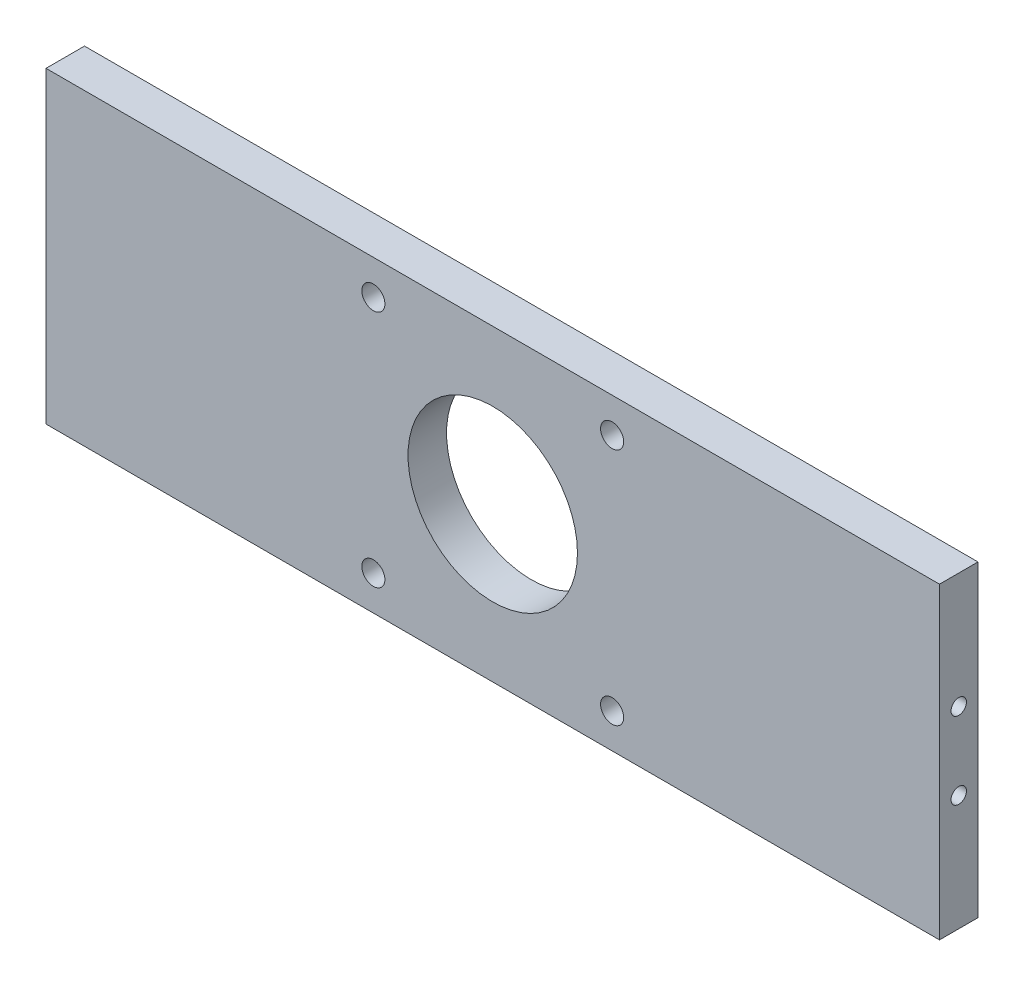
ISO-10303-21;
HEADER;
FILE_DESCRIPTION(('STEP AP214'),'2;1');
FILE_NAME('part.step','',(''),(''),'','','');
FILE_SCHEMA(('AUTOMOTIVE_DESIGN { 1 0 10303 214 1 1 1 1 }'));
ENDSEC;
DATA;
#1=APPLICATION_CONTEXT('core data for automotive mechanical design processes');
#2=APPLICATION_PROTOCOL_DEFINITION('international standard','automotive_design',2000,#1);
#3=PRODUCT_CONTEXT('',#1,'mechanical');
#4=PRODUCT('Part','Part','',(#3));
#5=PRODUCT_RELATED_PRODUCT_CATEGORY('part','',(#4));
#6=PRODUCT_DEFINITION_FORMATION('','',#4);
#7=PRODUCT_DEFINITION_CONTEXT('part definition',#1,'design');
#8=PRODUCT_DEFINITION('design','',#6,#7);
#9=PRODUCT_DEFINITION_SHAPE('','',#8);
#10=(LENGTH_UNIT() NAMED_UNIT(*) SI_UNIT(.MILLI.,.METRE.));
#11=(NAMED_UNIT(*) PLANE_ANGLE_UNIT() SI_UNIT($,.RADIAN.));
#12=(NAMED_UNIT(*) SI_UNIT($,.STERADIAN.) SOLID_ANGLE_UNIT());
#13=UNCERTAINTY_MEASURE_WITH_UNIT(LENGTH_MEASURE(1.E-05),#10,'distance_accuracy_value','');
#14=(GEOMETRIC_REPRESENTATION_CONTEXT(3) GLOBAL_UNCERTAINTY_ASSIGNED_CONTEXT((#13)) GLOBAL_UNIT_ASSIGNED_CONTEXT((#10,
#11,#12)) REPRESENTATION_CONTEXT('',''));
#15=CARTESIAN_POINT('',(0.,0.,0.));
#16=DIRECTION('',(0.,0.,1.));
#17=DIRECTION('',(1.,0.,0.));
#18=AXIS2_PLACEMENT_3D('',#15,#16,#17);
#19=CARTESIAN_POINT('',(-58.,0.,5.));
#20=DIRECTION('',(1.,0.,0.));
#21=DIRECTION('',(0.,1.,0.));
#22=AXIS2_PLACEMENT_3D('',#19,#20,#21);
#23=PLANE('',#22);
#24=DIRECTION('',(0.,-1.,0.));
#25=VECTOR('',#24,1.);
#26=CARTESIAN_POINT('',(-58.,0.,0.));
#27=LINE('',#26,#25);
#28=CARTESIAN_POINT('',(-58.,20.,0.));
#29=VERTEX_POINT('',#28);
#30=CARTESIAN_POINT('',(-58.,-20.,0.));
#31=VERTEX_POINT('',#30);
#32=EDGE_CURVE('E122',#29,#31,#27,.T.);
#33=ORIENTED_EDGE('',*,*,#32,.T.);
#34=DIRECTION('',(0.,0.,-1.));
#35=VECTOR('',#34,1.);
#36=CARTESIAN_POINT('',(-58.,-20.,5.));
#37=LINE('',#36,#35);
#38=CARTESIAN_POINT('',(-58.,-20.,5.));
#39=VERTEX_POINT('',#38);
#40=EDGE_CURVE('E89',#39,#31,#37,.T.);
#41=ORIENTED_EDGE('',*,*,#40,.F.);
#42=DIRECTION('',(0.,-1.,0.));
#43=VECTOR('',#42,1.);
#44=CARTESIAN_POINT('',(-58.,0.,5.));
#45=LINE('',#44,#43);
#46=CARTESIAN_POINT('',(-58.,20.,5.));
#47=VERTEX_POINT('',#46);
#48=EDGE_CURVE('E91',#47,#39,#45,.T.);
#49=ORIENTED_EDGE('',*,*,#48,.F.);
#50=DIRECTION('',(0.,0.,-1.));
#51=VECTOR('',#50,1.);
#52=CARTESIAN_POINT('',(-58.,20.,5.));
#53=LINE('',#52,#51);
#54=EDGE_CURVE('E43',#47,#29,#53,.T.);
#55=ORIENTED_EDGE('',*,*,#54,.T.);
#56=EDGE_LOOP('',(#33,#41,#49,#55));
#57=FACE_BOUND('',#56,.T.);
#58=CARTESIAN_POINT('',(-58.,-5.00000000000001,2.5));
#59=DIRECTION('',(-1.,0.,0.));
#60=DIRECTION('',(0.,0.,1.));
#61=AXIS2_PLACEMENT_3D('',#58,#59,#60);
#62=CIRCLE('',#61,1.);
#63=CARTESIAN_POINT('',(-58.,-5.00000000000001,3.5));
#64=VERTEX_POINT('',#63);
#65=EDGE_CURVE('E337',#64,#64,#62,.F.);
#66=ORIENTED_EDGE('',*,*,#65,.T.);
#67=EDGE_LOOP('',(#66));
#68=FACE_BOUND('',#67,.T.);
#69=CARTESIAN_POINT('',(-58.,4.99999999999999,2.5));
#70=DIRECTION('',(-1.,0.,0.));
#71=DIRECTION('',(0.,0.,1.));
#72=AXIS2_PLACEMENT_3D('',#69,#70,#71);
#73=CIRCLE('',#72,1.);
#74=CARTESIAN_POINT('',(-58.,4.99999999999999,3.5));
#75=VERTEX_POINT('',#74);
#76=EDGE_CURVE('E330',#75,#75,#73,.T.);
#77=ORIENTED_EDGE('',*,*,#76,.F.);
#78=EDGE_LOOP('',(#77));
#79=FACE_BOUND('',#78,.T.);
#80=ADVANCED_FACE('F34',(#57,#68,#79),#23,.F.);
#81=CARTESIAN_POINT('',(58.,0.,5.));
#82=DIRECTION('',(1.,0.,0.));
#83=DIRECTION('',(0.,1.,0.));
#84=AXIS2_PLACEMENT_3D('',#81,#82,#83);
#85=PLANE('',#84);
#86=DIRECTION('',(0.,-1.,0.));
#87=VECTOR('',#86,1.);
#88=CARTESIAN_POINT('',(58.,0.,0.));
#89=LINE('',#88,#87);
#90=CARTESIAN_POINT('',(58.,20.,0.));
#91=VERTEX_POINT('',#90);
#92=CARTESIAN_POINT('',(58.,-20.,0.));
#93=VERTEX_POINT('',#92);
#94=EDGE_CURVE('E119',#91,#93,#89,.T.);
#95=ORIENTED_EDGE('',*,*,#94,.F.);
#96=DIRECTION('',(0.,0.,-1.));
#97=VECTOR('',#96,1.);
#98=CARTESIAN_POINT('',(58.,20.,5.));
#99=LINE('',#98,#97);
#100=CARTESIAN_POINT('',(58.,20.,5.));
#101=VERTEX_POINT('',#100);
#102=EDGE_CURVE('E11',#101,#91,#99,.T.);
#103=ORIENTED_EDGE('',*,*,#102,.F.);
#104=DIRECTION('',(0.,-1.,0.));
#105=VECTOR('',#104,1.);
#106=CARTESIAN_POINT('',(58.,0.,5.));
#107=LINE('',#106,#105);
#108=CARTESIAN_POINT('',(58.,-20.,5.));
#109=VERTEX_POINT('',#108);
#110=EDGE_CURVE('E96',#101,#109,#107,.T.);
#111=ORIENTED_EDGE('',*,*,#110,.T.);
#112=DIRECTION('',(0.,0.,-1.));
#113=VECTOR('',#112,1.);
#114=CARTESIAN_POINT('',(58.,-20.,5.));
#115=LINE('',#114,#113);
#116=EDGE_CURVE('E74',#109,#93,#115,.T.);
#117=ORIENTED_EDGE('',*,*,#116,.T.);
#118=EDGE_LOOP('',(#95,#103,#111,#117));
#119=FACE_BOUND('',#118,.T.);
#120=CARTESIAN_POINT('',(58.,5.00000000000001,2.5));
#121=DIRECTION('',(1.,0.,0.));
#122=DIRECTION('',(0.,0.,-1.));
#123=AXIS2_PLACEMENT_3D('',#120,#121,#122);
#124=CIRCLE('',#123,1.);
#125=CARTESIAN_POINT('',(58.,5.00000000000001,1.5));
#126=VERTEX_POINT('',#125);
#127=EDGE_CURVE('E141',#126,#126,#124,.T.);
#128=ORIENTED_EDGE('',*,*,#127,.F.);
#129=EDGE_LOOP('',(#128));
#130=FACE_BOUND('',#129,.T.);
#131=CARTESIAN_POINT('',(58.,-4.99999999999999,2.5));
#132=DIRECTION('',(1.,0.,0.));
#133=DIRECTION('',(0.,0.,-1.));
#134=AXIS2_PLACEMENT_3D('',#131,#132,#133);
#135=CIRCLE('',#134,1.);
#136=CARTESIAN_POINT('',(58.,-4.99999999999999,1.5));
#137=VERTEX_POINT('',#136);
#138=EDGE_CURVE('E144',#137,#137,#135,.F.);
#139=ORIENTED_EDGE('',*,*,#138,.T.);
#140=EDGE_LOOP('',(#139));
#141=FACE_BOUND('',#140,.T.);
#142=ADVANCED_FACE('F134',(#119,#130,#141),#85,.T.);
#143=CARTESIAN_POINT('',(0.,20.,5.));
#144=DIRECTION('',(0.,1.,0.));
#145=DIRECTION('',(0.,0.,1.));
#146=AXIS2_PLACEMENT_3D('',#143,#144,#145);
#147=PLANE('',#146);
#148=DIRECTION('',(1.,0.,0.));
#149=VECTOR('',#148,1.);
#150=CARTESIAN_POINT('',(0.,20.,0.));
#151=LINE('',#150,#149);
#152=EDGE_CURVE('E86',#29,#91,#151,.T.);
#153=ORIENTED_EDGE('',*,*,#152,.F.);
#154=ORIENTED_EDGE('',*,*,#54,.F.);
#155=DIRECTION('',(1.,0.,0.));
#156=VECTOR('',#155,1.);
#157=CARTESIAN_POINT('',(0.,20.,5.));
#158=LINE('',#157,#156);
#159=EDGE_CURVE('E84',#47,#101,#158,.T.);
#160=ORIENTED_EDGE('',*,*,#159,.T.);
#161=ORIENTED_EDGE('',*,*,#102,.T.);
#162=EDGE_LOOP('',(#153,#154,#160,#161));
#163=FACE_BOUND('',#162,.T.);
#164=ADVANCED_FACE('F82',(#163),#147,.T.);
#165=CARTESIAN_POINT('',(0.,-20.,5.));
#166=DIRECTION('',(0.,1.,0.));
#167=DIRECTION('',(0.,0.,1.));
#168=AXIS2_PLACEMENT_3D('',#165,#166,#167);
#169=PLANE('',#168);
#170=DIRECTION('',(1.,0.,0.));
#171=VECTOR('',#170,1.);
#172=CARTESIAN_POINT('',(0.,-20.,0.));
#173=LINE('',#172,#171);
#174=EDGE_CURVE('E67',#31,#93,#173,.T.);
#175=ORIENTED_EDGE('',*,*,#174,.T.);
#176=ORIENTED_EDGE('',*,*,#116,.F.);
#177=DIRECTION('',(1.,0.,0.));
#178=VECTOR('',#177,1.);
#179=CARTESIAN_POINT('',(0.,-20.,5.));
#180=LINE('',#179,#178);
#181=EDGE_CURVE('E51',#39,#109,#180,.T.);
#182=ORIENTED_EDGE('',*,*,#181,.F.);
#183=ORIENTED_EDGE('',*,*,#40,.T.);
#184=EDGE_LOOP('',(#175,#176,#182,#183));
#185=FACE_BOUND('',#184,.T.);
#186=ADVANCED_FACE('F131',(#185),#169,.F.);
#187=CARTESIAN_POINT('',(-15.5,15.5,5.));
#188=DIRECTION('',(0.,0.,-1.));
#189=DIRECTION('',(-1.,0.,0.));
#190=AXIS2_PLACEMENT_3D('',#187,#188,#189);
#191=CYLINDRICAL_SURFACE('',#190,1.5);
#192=CARTESIAN_POINT('',(-15.5,15.5,5.));
#193=DIRECTION('',(0.,0.,1.));
#194=DIRECTION('',(1.,0.,0.));
#195=AXIS2_PLACEMENT_3D('',#192,#193,#194);
#196=CIRCLE('',#195,1.5);
#197=CARTESIAN_POINT('',(-14.,15.5,5.));
#198=VERTEX_POINT('',#197);
#199=EDGE_CURVE('E98',#198,#198,#196,.T.);
#200=ORIENTED_EDGE('',*,*,#199,.T.);
#201=EDGE_LOOP('',(#200));
#202=FACE_BOUND('',#201,.T.);
#203=CARTESIAN_POINT('',(-15.5,15.5,0.));
#204=DIRECTION('',(0.,0.,1.));
#205=DIRECTION('',(1.,0.,0.));
#206=AXIS2_PLACEMENT_3D('',#203,#204,#205);
#207=CIRCLE('',#206,1.5);
#208=CARTESIAN_POINT('',(-14.,15.5,0.));
#209=VERTEX_POINT('',#208);
#210=EDGE_CURVE('E116',#209,#209,#207,.T.);
#211=ORIENTED_EDGE('',*,*,#210,.F.);
#212=EDGE_LOOP('',(#211));
#213=FACE_BOUND('',#212,.T.);
#214=ADVANCED_FACE('F166',(#202,#213),#191,.F.);
#215=CARTESIAN_POINT('',(-15.5,-15.5,5.));
#216=DIRECTION('',(0.,0.,-1.));
#217=DIRECTION('',(-1.,0.,0.));
#218=AXIS2_PLACEMENT_3D('',#215,#216,#217);
#219=CYLINDRICAL_SURFACE('',#218,1.5);
#220=CARTESIAN_POINT('',(-15.5,-15.5,5.));
#221=DIRECTION('',(0.,0.,1.));
#222=DIRECTION('',(1.,0.,0.));
#223=AXIS2_PLACEMENT_3D('',#220,#221,#222);
#224=CIRCLE('',#223,1.5);
#225=CARTESIAN_POINT('',(-14.,-15.5,5.));
#226=VERTEX_POINT('',#225);
#227=EDGE_CURVE('E161',#226,#226,#224,.T.);
#228=ORIENTED_EDGE('',*,*,#227,.T.);
#229=EDGE_LOOP('',(#228));
#230=FACE_BOUND('',#229,.T.);
#231=CARTESIAN_POINT('',(-15.5,-15.5,0.));
#232=DIRECTION('',(0.,0.,1.));
#233=DIRECTION('',(1.,0.,0.));
#234=AXIS2_PLACEMENT_3D('',#231,#232,#233);
#235=CIRCLE('',#234,1.5);
#236=CARTESIAN_POINT('',(-14.,-15.5,0.));
#237=VERTEX_POINT('',#236);
#238=EDGE_CURVE('E113',#237,#237,#235,.T.);
#239=ORIENTED_EDGE('',*,*,#238,.F.);
#240=EDGE_LOOP('',(#239));
#241=FACE_BOUND('',#240,.T.);
#242=ADVANCED_FACE('F195',(#230,#241),#219,.F.);
#243=CARTESIAN_POINT('',(15.5,15.5,5.));
#244=DIRECTION('',(0.,0.,-1.));
#245=DIRECTION('',(-1.,0.,0.));
#246=AXIS2_PLACEMENT_3D('',#243,#244,#245);
#247=CYLINDRICAL_SURFACE('',#246,1.5);
#248=CARTESIAN_POINT('',(15.5,15.5,5.));
#249=DIRECTION('',(0.,0.,1.));
#250=DIRECTION('',(1.,0.,0.));
#251=AXIS2_PLACEMENT_3D('',#248,#249,#250);
#252=CIRCLE('',#251,1.5);
#253=CARTESIAN_POINT('',(17.,15.5,5.));
#254=VERTEX_POINT('',#253);
#255=EDGE_CURVE('E158',#254,#254,#252,.T.);
#256=ORIENTED_EDGE('',*,*,#255,.T.);
#257=EDGE_LOOP('',(#256));
#258=FACE_BOUND('',#257,.T.);
#259=CARTESIAN_POINT('',(15.5,15.5,0.));
#260=DIRECTION('',(0.,0.,1.));
#261=DIRECTION('',(1.,0.,0.));
#262=AXIS2_PLACEMENT_3D('',#259,#260,#261);
#263=CIRCLE('',#262,1.5);
#264=CARTESIAN_POINT('',(17.,15.5,0.));
#265=VERTEX_POINT('',#264);
#266=EDGE_CURVE('E109',#265,#265,#263,.T.);
#267=ORIENTED_EDGE('',*,*,#266,.F.);
#268=EDGE_LOOP('',(#267));
#269=FACE_BOUND('',#268,.T.);
#270=ADVANCED_FACE('F197',(#258,#269),#247,.F.);
#271=CARTESIAN_POINT('',(15.5,-15.5,5.));
#272=DIRECTION('',(0.,0.,-1.));
#273=DIRECTION('',(-1.,0.,0.));
#274=AXIS2_PLACEMENT_3D('',#271,#272,#273);
#275=CYLINDRICAL_SURFACE('',#274,1.5);
#276=CARTESIAN_POINT('',(15.5,-15.5,5.));
#277=DIRECTION('',(0.,0.,1.));
#278=DIRECTION('',(1.,0.,0.));
#279=AXIS2_PLACEMENT_3D('',#276,#277,#278);
#280=CIRCLE('',#279,1.5);
#281=CARTESIAN_POINT('',(17.,-15.5,5.));
#282=VERTEX_POINT('',#281);
#283=EDGE_CURVE('E128',#282,#282,#280,.T.);
#284=ORIENTED_EDGE('',*,*,#283,.T.);
#285=EDGE_LOOP('',(#284));
#286=FACE_BOUND('',#285,.T.);
#287=CARTESIAN_POINT('',(15.5,-15.5,0.));
#288=DIRECTION('',(0.,0.,1.));
#289=DIRECTION('',(1.,0.,0.));
#290=AXIS2_PLACEMENT_3D('',#287,#288,#289);
#291=CIRCLE('',#290,1.5);
#292=CARTESIAN_POINT('',(17.,-15.5,0.));
#293=VERTEX_POINT('',#292);
#294=EDGE_CURVE('E106',#293,#293,#291,.T.);
#295=ORIENTED_EDGE('',*,*,#294,.F.);
#296=EDGE_LOOP('',(#295));
#297=FACE_BOUND('',#296,.T.);
#298=ADVANCED_FACE('F36',(#286,#297),#275,.F.);
#299=CARTESIAN_POINT('',(0.,0.,5.));
#300=DIRECTION('',(0.,0.,-1.));
#301=DIRECTION('',(-1.,0.,0.));
#302=AXIS2_PLACEMENT_3D('',#299,#300,#301);
#303=CYLINDRICAL_SURFACE('',#302,11.);
#304=CARTESIAN_POINT('',(0.,0.,5.));
#305=DIRECTION('',(0.,0.,1.));
#306=DIRECTION('',(1.,0.,0.));
#307=AXIS2_PLACEMENT_3D('',#304,#305,#306);
#308=CIRCLE('',#307,11.);
#309=CARTESIAN_POINT('',(11.,0.,5.));
#310=VERTEX_POINT('',#309);
#311=EDGE_CURVE('E103',#310,#310,#308,.T.);
#312=ORIENTED_EDGE('',*,*,#311,.T.);
#313=EDGE_LOOP('',(#312));
#314=FACE_BOUND('',#313,.T.);
#315=CARTESIAN_POINT('',(0.,0.,0.));
#316=DIRECTION('',(0.,0.,1.));
#317=DIRECTION('',(1.,0.,0.));
#318=AXIS2_PLACEMENT_3D('',#315,#316,#317);
#319=CIRCLE('',#318,11.);
#320=CARTESIAN_POINT('',(11.,0.,0.));
#321=VERTEX_POINT('',#320);
#322=EDGE_CURVE('E125',#321,#321,#319,.T.);
#323=ORIENTED_EDGE('',*,*,#322,.F.);
#324=EDGE_LOOP('',(#323));
#325=FACE_BOUND('',#324,.T.);
#326=ADVANCED_FACE('F170',(#314,#325),#303,.F.);
#327=CARTESIAN_POINT('',(0.,0.,5.));
#328=DIRECTION('',(0.,0.,1.));
#329=DIRECTION('',(1.,0.,0.));
#330=AXIS2_PLACEMENT_3D('',#327,#328,#329);
#331=PLANE('',#330);
#332=ORIENTED_EDGE('',*,*,#283,.F.);
#333=EDGE_LOOP('',(#332));
#334=FACE_BOUND('',#333,.T.);
#335=ORIENTED_EDGE('',*,*,#255,.F.);
#336=EDGE_LOOP('',(#335));
#337=FACE_BOUND('',#336,.T.);
#338=ORIENTED_EDGE('',*,*,#227,.F.);
#339=EDGE_LOOP('',(#338));
#340=FACE_BOUND('',#339,.T.);
#341=ORIENTED_EDGE('',*,*,#199,.F.);
#342=EDGE_LOOP('',(#341));
#343=FACE_BOUND('',#342,.T.);
#344=ORIENTED_EDGE('',*,*,#110,.F.);
#345=ORIENTED_EDGE('',*,*,#159,.F.);
#346=ORIENTED_EDGE('',*,*,#48,.T.);
#347=ORIENTED_EDGE('',*,*,#181,.T.);
#348=EDGE_LOOP('',(#344,#345,#346,#347));
#349=FACE_BOUND('',#348,.T.);
#350=ORIENTED_EDGE('',*,*,#311,.F.);
#351=EDGE_LOOP('',(#350));
#352=FACE_BOUND('',#351,.T.);
#353=ADVANCED_FACE('F94',(#334,#337,#340,#343,#349,#352),#331,.T.);
#354=CARTESIAN_POINT('',(0.,0.,0.));
#355=DIRECTION('',(0.,0.,1.));
#356=DIRECTION('',(1.,0.,0.));
#357=AXIS2_PLACEMENT_3D('',#354,#355,#356);
#358=PLANE('',#357);
#359=ORIENTED_EDGE('',*,*,#294,.T.);
#360=EDGE_LOOP('',(#359));
#361=FACE_BOUND('',#360,.T.);
#362=ORIENTED_EDGE('',*,*,#266,.T.);
#363=EDGE_LOOP('',(#362));
#364=FACE_BOUND('',#363,.T.);
#365=ORIENTED_EDGE('',*,*,#238,.T.);
#366=EDGE_LOOP('',(#365));
#367=FACE_BOUND('',#366,.T.);
#368=ORIENTED_EDGE('',*,*,#210,.T.);
#369=EDGE_LOOP('',(#368));
#370=FACE_BOUND('',#369,.T.);
#371=ORIENTED_EDGE('',*,*,#94,.T.);
#372=ORIENTED_EDGE('',*,*,#174,.F.);
#373=ORIENTED_EDGE('',*,*,#32,.F.);
#374=ORIENTED_EDGE('',*,*,#152,.T.);
#375=EDGE_LOOP('',(#371,#372,#373,#374));
#376=FACE_BOUND('',#375,.T.);
#377=ORIENTED_EDGE('',*,*,#322,.T.);
#378=EDGE_LOOP('',(#377));
#379=FACE_BOUND('',#378,.T.);
#380=ADVANCED_FACE('F132',(#361,#364,#367,#370,#376,#379),#358,.F.);
#381=CARTESIAN_POINT('',(48.,5.00000000000001,2.5));
#382=DIRECTION('',(1.,0.,0.));
#383=DIRECTION('',(0.,0.,-1.));
#384=AXIS2_PLACEMENT_3D('',#381,#382,#383);
#385=CYLINDRICAL_SURFACE('',#384,1.);
#386=CARTESIAN_POINT('',(48.,5.00000000000001,2.5));
#387=DIRECTION('',(1.,0.,0.));
#388=DIRECTION('',(0.,0.,-1.));
#389=AXIS2_PLACEMENT_3D('',#386,#387,#388);
#390=CIRCLE('',#389,1.);
#391=CARTESIAN_POINT('',(48.,5.00000000000001,1.5));
#392=VERTEX_POINT('',#391);
#393=EDGE_CURVE('E149',#392,#392,#390,.T.);
#394=ORIENTED_EDGE('',*,*,#393,.F.);
#395=EDGE_LOOP('',(#394));
#396=FACE_BOUND('',#395,.T.);
#397=ORIENTED_EDGE('',*,*,#127,.T.);
#398=EDGE_LOOP('',(#397));
#399=FACE_BOUND('',#398,.T.);
#400=ADVANCED_FACE('F177',(#396,#399),#385,.F.);
#401=CARTESIAN_POINT('',(48.,5.00000000000001,2.5));
#402=DIRECTION('',(1.,0.,0.));
#403=DIRECTION('',(0.,0.,-1.));
#404=AXIS2_PLACEMENT_3D('',#401,#402,#403);
#405=PLANE('',#404);
#406=ORIENTED_EDGE('',*,*,#393,.T.);
#407=EDGE_LOOP('',(#406));
#408=FACE_BOUND('',#407,.T.);
#409=ADVANCED_FACE('F251',(#408),#405,.T.);
#410=CARTESIAN_POINT('',(48.,-4.99999999999999,2.5));
#411=DIRECTION('',(1.,0.,0.));
#412=DIRECTION('',(0.,0.,-1.));
#413=AXIS2_PLACEMENT_3D('',#410,#411,#412);
#414=CYLINDRICAL_SURFACE('',#413,1.);
#415=CARTESIAN_POINT('',(48.,-4.99999999999999,2.5));
#416=DIRECTION('',(1.,0.,0.));
#417=DIRECTION('',(0.,0.,-1.));
#418=AXIS2_PLACEMENT_3D('',#415,#416,#417);
#419=CIRCLE('',#418,1.);
#420=CARTESIAN_POINT('',(48.,-4.99999999999999,1.5));
#421=VERTEX_POINT('',#420);
#422=EDGE_CURVE('E110',#421,#421,#419,.F.);
#423=ORIENTED_EDGE('',*,*,#422,.T.);
#424=EDGE_LOOP('',(#423));
#425=FACE_BOUND('',#424,.T.);
#426=ORIENTED_EDGE('',*,*,#138,.F.);
#427=EDGE_LOOP('',(#426));
#428=FACE_BOUND('',#427,.T.);
#429=ADVANCED_FACE('F261',(#425,#428),#414,.F.);
#430=CARTESIAN_POINT('',(48.,0.,0.));
#431=DIRECTION('',(1.,0.,0.));
#432=DIRECTION('',(0.,0.,-1.));
#433=AXIS2_PLACEMENT_3D('',#430,#431,#432);
#434=PLANE('',#433);
#435=ORIENTED_EDGE('',*,*,#422,.F.);
#436=EDGE_LOOP('',(#435));
#437=FACE_BOUND('',#436,.T.);
#438=ADVANCED_FACE('F270',(#437),#434,.T.);
#439=CARTESIAN_POINT('',(-53.,-5.00000000000001,2.5));
#440=DIRECTION('',(-1.,0.,0.));
#441=DIRECTION('',(0.,-1.,0.));
#442=AXIS2_PLACEMENT_3D('',#439,#440,#441);
#443=CYLINDRICAL_SURFACE('',#442,1.);
#444=CARTESIAN_POINT('',(-53.,-5.00000000000001,2.5));
#445=DIRECTION('',(-1.,0.,0.));
#446=DIRECTION('',(0.,0.,1.));
#447=AXIS2_PLACEMENT_3D('',#444,#445,#446);
#448=CIRCLE('',#447,1.);
#449=CARTESIAN_POINT('',(-53.,-5.00000000000001,3.5));
#450=VERTEX_POINT('',#449);
#451=EDGE_CURVE('E333',#450,#450,#448,.F.);
#452=ORIENTED_EDGE('',*,*,#451,.T.);
#453=EDGE_LOOP('',(#452));
#454=FACE_BOUND('',#453,.T.);
#455=ORIENTED_EDGE('',*,*,#65,.F.);
#456=EDGE_LOOP('',(#455));
#457=FACE_BOUND('',#456,.T.);
#458=ADVANCED_FACE('F279',(#454,#457),#443,.F.);
#459=CARTESIAN_POINT('',(-53.,0.,0.));
#460=DIRECTION('',(-1.,0.,0.));
#461=DIRECTION('',(0.,0.,1.));
#462=AXIS2_PLACEMENT_3D('',#459,#460,#461);
#463=PLANE('',#462);
#464=ORIENTED_EDGE('',*,*,#451,.F.);
#465=EDGE_LOOP('',(#464));
#466=FACE_BOUND('',#465,.T.);
#467=ADVANCED_FACE('F294',(#466),#463,.T.);
#468=CARTESIAN_POINT('',(-53.,4.99999999999999,2.5));
#469=DIRECTION('',(-1.,0.,0.));
#470=DIRECTION('',(0.,-1.,0.));
#471=AXIS2_PLACEMENT_3D('',#468,#469,#470);
#472=CYLINDRICAL_SURFACE('',#471,1.);
#473=CARTESIAN_POINT('',(-53.,4.99999999999999,2.5));
#474=DIRECTION('',(-1.,0.,0.));
#475=DIRECTION('',(0.,0.,1.));
#476=AXIS2_PLACEMENT_3D('',#473,#474,#475);
#477=CIRCLE('',#476,1.);
#478=CARTESIAN_POINT('',(-53.,4.99999999999999,3.5));
#479=VERTEX_POINT('',#478);
#480=EDGE_CURVE('E155',#479,#479,#477,.T.);
#481=ORIENTED_EDGE('',*,*,#480,.F.);
#482=EDGE_LOOP('',(#481));
#483=FACE_BOUND('',#482,.T.);
#484=ORIENTED_EDGE('',*,*,#76,.T.);
#485=EDGE_LOOP('',(#484));
#486=FACE_BOUND('',#485,.T.);
#487=ADVANCED_FACE('F304',(#483,#486),#472,.F.);
#488=CARTESIAN_POINT('',(-53.,0.,0.));
#489=DIRECTION('',(-1.,0.,0.));
#490=DIRECTION('',(0.,0.,1.));
#491=AXIS2_PLACEMENT_3D('',#488,#489,#490);
#492=PLANE('',#491);
#493=ORIENTED_EDGE('',*,*,#480,.T.);
#494=EDGE_LOOP('',(#493));
#495=FACE_BOUND('',#494,.T.);
#496=ADVANCED_FACE('F314',(#495),#492,.T.);
#497=CLOSED_SHELL('',(#80,#142,#164,#186,#214,#242,#270,#298,#326,#353,#380,#400,#409,#429,#438,
#458,#467,#487,#496));
#498=MANIFOLD_SOLID_BREP('B2',#497);
#499=ADVANCED_BREP_SHAPE_REPRESENTATION('',(#18,#498),#14);
#500=SHAPE_DEFINITION_REPRESENTATION(#9,#499);
ENDSEC;
END-ISO-10303-21;
